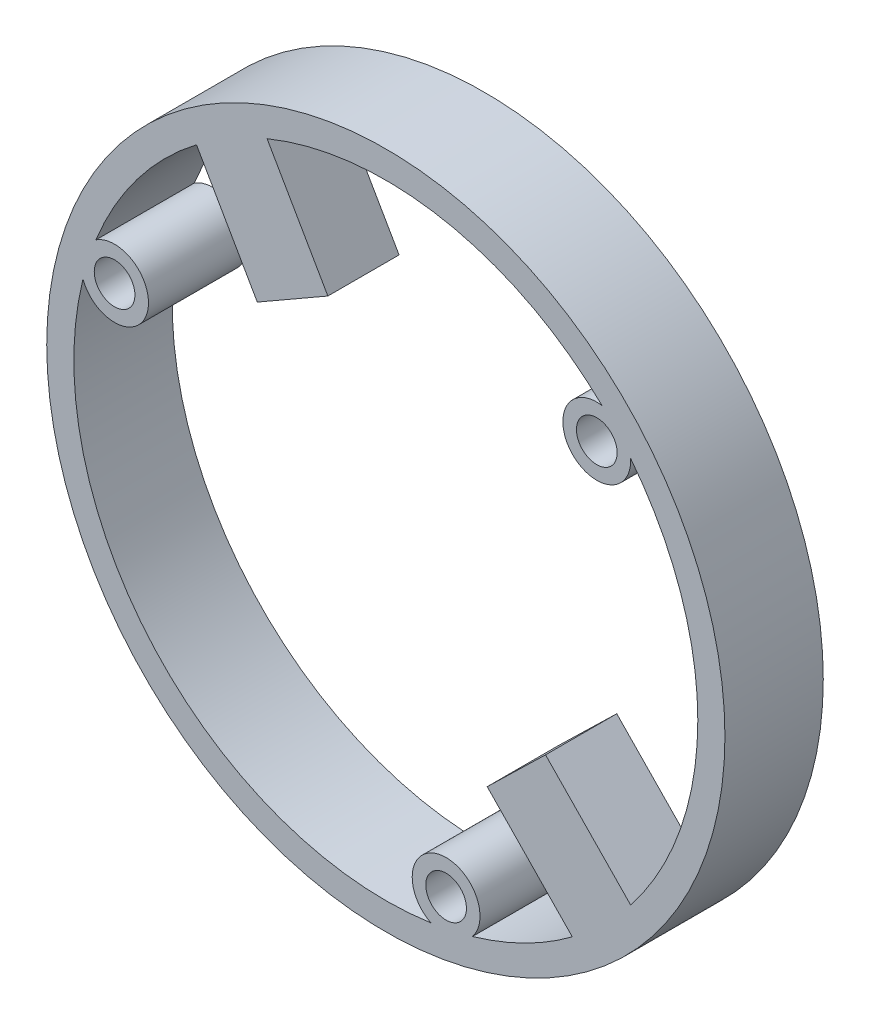
ISO-10303-21;
HEADER;
FILE_DESCRIPTION(('STEP AP214'),'2;1');
FILE_NAME('part.step','',(''),(''),'','','');
FILE_SCHEMA(('AUTOMOTIVE_DESIGN { 1 0 10303 214 1 1 1 1 }'));
ENDSEC;
DATA;
#1=APPLICATION_CONTEXT('core data for automotive mechanical design processes');
#2=APPLICATION_PROTOCOL_DEFINITION('international standard','automotive_design',2000,#1);
#3=PRODUCT_CONTEXT('',#1,'mechanical');
#4=PRODUCT('Part','Part','',(#3));
#5=PRODUCT_RELATED_PRODUCT_CATEGORY('part','',(#4));
#6=PRODUCT_DEFINITION_FORMATION('','',#4);
#7=PRODUCT_DEFINITION_CONTEXT('part definition',#1,'design');
#8=PRODUCT_DEFINITION('design','',#6,#7);
#9=PRODUCT_DEFINITION_SHAPE('','',#8);
#10=(LENGTH_UNIT() NAMED_UNIT(*) SI_UNIT(.MILLI.,.METRE.));
#11=(NAMED_UNIT(*) PLANE_ANGLE_UNIT() SI_UNIT($,.RADIAN.));
#12=(NAMED_UNIT(*) SI_UNIT($,.STERADIAN.) SOLID_ANGLE_UNIT());
#13=UNCERTAINTY_MEASURE_WITH_UNIT(LENGTH_MEASURE(1.E-05),#10,'distance_accuracy_value','');
#14=(GEOMETRIC_REPRESENTATION_CONTEXT(3) GLOBAL_UNCERTAINTY_ASSIGNED_CONTEXT((#13)) GLOBAL_UNIT_ASSIGNED_CONTEXT((#10,
#11,#12)) REPRESENTATION_CONTEXT('',''));
#15=CARTESIAN_POINT('',(0.,0.,0.));
#16=DIRECTION('',(0.,0.,1.));
#17=DIRECTION('',(1.,0.,0.));
#18=AXIS2_PLACEMENT_3D('',#15,#16,#17);
#19=CARTESIAN_POINT('',(-8.75506408313874,21.2684943731364,7.25));
#20=DIRECTION('',(-0.867166540666865,-0.498018263468181,0.));
#21=DIRECTION('',(0.498018263468181,-0.867166540666865,0.));
#22=AXIS2_PLACEMENT_3D('',#19,#20,#21);
#23=PLANE('',#22);
#24=DIRECTION('',(0.498018263468181,-0.867166540666865,0.));
#25=VECTOR('',#24,1.);
#26=CARTESIAN_POINT('',(-4.27289971192511,13.4639955071346,2.));
#27=LINE('',#26,#25);
#28=CARTESIAN_POINT('',(-8.75506408313874,21.2684943731364,2.));
#29=VERTEX_POINT('',#28);
#30=CARTESIAN_POINT('',(-4.27289971192511,13.4639955071346,2.));
#31=VERTEX_POINT('',#30);
#32=EDGE_CURVE('E286',#29,#31,#27,.T.);
#33=ORIENTED_EDGE('',*,*,#32,.F.);
#34=DIRECTION('',(0.,0.,-1.));
#35=VECTOR('',#34,1.);
#36=CARTESIAN_POINT('',(-8.75506408313874,21.2684943731364,7.25));
#37=LINE('',#36,#35);
#38=CARTESIAN_POINT('',(-8.75506408313874,21.2684943731364,7.25));
#39=VERTEX_POINT('',#38);
#40=EDGE_CURVE('E191',#39,#29,#37,.T.);
#41=ORIENTED_EDGE('',*,*,#40,.F.);
#42=DIRECTION('',(-0.498018263468181,0.867166540666865,0.));
#43=VECTOR('',#42,1.);
#44=CARTESIAN_POINT('',(-8.75506408313874,21.2684943731364,7.25));
#45=LINE('',#44,#43);
#46=CARTESIAN_POINT('',(-4.27289971192511,13.4639955071346,7.25));
#47=VERTEX_POINT('',#46);
#48=EDGE_CURVE('E307',#47,#39,#45,.T.);
#49=ORIENTED_EDGE('',*,*,#48,.F.);
#50=DIRECTION('',(0.,0.,-1.));
#51=VECTOR('',#50,1.);
#52=CARTESIAN_POINT('',(-4.27289971192511,13.4639955071346,7.25));
#53=LINE('',#52,#51);
#54=EDGE_CURVE('E194',#47,#31,#53,.T.);
#55=ORIENTED_EDGE('',*,*,#54,.T.);
#56=EDGE_LOOP('',(#33,#41,#49,#55));
#57=FACE_BOUND('',#56,.T.);
#58=ADVANCED_FACE('F45',(#57),#23,.F.);
#59=CARTESIAN_POINT('',(-4.27289971192511,13.4639955071346,7.25));
#60=DIRECTION('',(-0.49801826346818,0.867166540666865,0.));
#61=DIRECTION('',(-0.867166540666865,-0.498018263468181,0.));
#62=AXIS2_PLACEMENT_3D('',#59,#60,#61);
#63=PLANE('',#62);
#64=DIRECTION('',(-0.867166540666865,-0.49801826346818,0.));
#65=VECTOR('',#64,1.);
#66=CARTESIAN_POINT('',(-4.27289971192511,13.4639955071346,2.));
#67=LINE('',#66,#65);
#68=CARTESIAN_POINT('',(-9.4758989559263,10.4758859263255,2.));
#69=VERTEX_POINT('',#68);
#70=EDGE_CURVE('E280',#31,#69,#67,.T.);
#71=ORIENTED_EDGE('',*,*,#70,.F.);
#72=ORIENTED_EDGE('',*,*,#54,.F.);
#73=DIRECTION('',(0.867166540666865,0.49801826346818,0.));
#74=VECTOR('',#73,1.);
#75=CARTESIAN_POINT('',(-4.27289971192511,13.4639955071346,7.25));
#76=LINE('',#75,#74);
#77=CARTESIAN_POINT('',(-9.4758989559263,10.4758859263255,7.25));
#78=VERTEX_POINT('',#77);
#79=EDGE_CURVE('E304',#78,#47,#76,.T.);
#80=ORIENTED_EDGE('',*,*,#79,.F.);
#81=DIRECTION('',(0.,0.,-1.));
#82=VECTOR('',#81,1.);
#83=CARTESIAN_POINT('',(-9.4758989559263,10.4758859263255,7.25));
#84=LINE('',#83,#82);
#85=EDGE_CURVE('E197',#78,#69,#84,.T.);
#86=ORIENTED_EDGE('',*,*,#85,.T.);
#87=EDGE_LOOP('',(#71,#72,#80,#86));
#88=FACE_BOUND('',#87,.T.);
#89=ADVANCED_FACE('F373',(#88),#63,.F.);
#90=CARTESIAN_POINT('',(-13.9580633271399,18.2803847923273,7.25));
#91=DIRECTION('',(0.867166540666865,0.498018263468181,0.));
#92=DIRECTION('',(-0.498018263468181,0.867166540666865,0.));
#93=AXIS2_PLACEMENT_3D('',#90,#91,#92);
#94=PLANE('',#93);
#95=DIRECTION('',(-0.498018263468181,0.867166540666865,0.));
#96=VECTOR('',#95,1.);
#97=CARTESIAN_POINT('',(-9.4758989559263,10.4758859263255,2.));
#98=LINE('',#97,#96);
#99=CARTESIAN_POINT('',(-13.9580633271399,18.2803847923273,2.));
#100=VERTEX_POINT('',#99);
#101=EDGE_CURVE('E68',#69,#100,#98,.T.);
#102=ORIENTED_EDGE('',*,*,#101,.F.);
#103=ORIENTED_EDGE('',*,*,#85,.F.);
#104=DIRECTION('',(0.498018263468181,-0.867166540666865,0.));
#105=VECTOR('',#104,1.);
#106=CARTESIAN_POINT('',(-13.9580633271399,18.2803847923273,7.25));
#107=LINE('',#106,#105);
#108=CARTESIAN_POINT('',(-13.9580633271399,18.2803847923273,7.25));
#109=VERTEX_POINT('',#108);
#110=EDGE_CURVE('E301',#109,#78,#107,.T.);
#111=ORIENTED_EDGE('',*,*,#110,.F.);
#112=DIRECTION('',(0.,0.,-1.));
#113=VECTOR('',#112,1.);
#114=CARTESIAN_POINT('',(-13.9580633271399,18.2803847923273,7.25));
#115=LINE('',#114,#113);
#116=EDGE_CURVE('E200',#109,#100,#115,.T.);
#117=ORIENTED_EDGE('',*,*,#116,.T.);
#118=EDGE_LOOP('',(#102,#103,#111,#117));
#119=FACE_BOUND('',#118,.T.);
#120=ADVANCED_FACE('F370',(#119),#94,.F.);
#121=CARTESIAN_POINT('',(0.,0.,7.25));
#122=DIRECTION('',(0.,0.,1.));
#123=DIRECTION('',(1.,0.,0.));
#124=AXIS2_PLACEMENT_3D('',#121,#122,#123);
#125=PLANE('',#124);
#126=CARTESIAN_POINT('',(0.,0.,7.25));
#127=DIRECTION('',(0.,0.,1.));
#128=DIRECTION('',(1.,0.,0.));
#129=AXIS2_PLACEMENT_3D('',#126,#127,#128);
#130=CIRCLE('',#129,25.);
#131=CARTESIAN_POINT('',(25.,0.,7.25));
#132=VERTEX_POINT('',#131);
#133=EDGE_CURVE('E13',#132,#132,#130,.T.);
#134=ORIENTED_EDGE('',*,*,#133,.T.);
#135=EDGE_LOOP('',(#134));
#136=FACE_BOUND('',#135,.T.);
#137=CARTESIAN_POINT('',(15.5528440369997,14.1106003543706,7.25));
#138=DIRECTION('',(0.,0.,-1.));
#139=DIRECTION('',(-1.,0.,0.));
#140=AXIS2_PLACEMENT_3D('',#137,#138,#139);
#141=CIRCLE('',#140,1.5);
#142=CARTESIAN_POINT('',(14.0528440369997,14.1106003543706,7.25));
#143=VERTEX_POINT('',#142);
#144=EDGE_CURVE('E225',#143,#143,#141,.T.);
#145=ORIENTED_EDGE('',*,*,#144,.T.);
#146=EDGE_LOOP('',(#145));
#147=FACE_BOUND('',#146,.T.);
#148=CARTESIAN_POINT('',(-19.9965603880345,6.41385785995363,7.25));
#149=DIRECTION('',(0.,0.,-1.));
#150=DIRECTION('',(-1.,0.,0.));
#151=AXIS2_PLACEMENT_3D('',#148,#149,#150);
#152=CIRCLE('',#151,1.5);
#153=CARTESIAN_POINT('',(-21.4965603880345,6.41385785995363,7.25));
#154=VERTEX_POINT('',#153);
#155=EDGE_CURVE('E219',#154,#154,#152,.T.);
#156=ORIENTED_EDGE('',*,*,#155,.T.);
#157=EDGE_LOOP('',(#156));
#158=FACE_BOUND('',#157,.T.);
#159=CARTESIAN_POINT('',(4.44371635103502,-20.5244582143243,7.25));
#160=DIRECTION('',(0.,0.,-1.));
#161=DIRECTION('',(-1.,0.,0.));
#162=AXIS2_PLACEMENT_3D('',#159,#160,#161);
#163=CIRCLE('',#162,1.5);
#164=CARTESIAN_POINT('',(2.94371635103502,-20.5244582143243,7.25));
#165=VERTEX_POINT('',#164);
#166=EDGE_CURVE('E212',#165,#165,#163,.T.);
#167=ORIENTED_EDGE('',*,*,#166,.T.);
#168=EDGE_LOOP('',(#167));
#169=FACE_BOUND('',#168,.T.);
#170=CARTESIAN_POINT('',(0.,0.,7.25));
#171=DIRECTION('',(0.,0.,-1.));
#172=DIRECTION('',(-1.,0.,0.));
#173=AXIS2_PLACEMENT_3D('',#170,#171,#172);
#174=CIRCLE('',#173,23.);
#175=CARTESIAN_POINT('',(3.32222869980981,-22.7587960240905,7.25));
#176=VERTEX_POINT('',#175);
#177=CARTESIAN_POINT('',(-22.3291562878072,5.51441560590808,7.25));
#178=VERTEX_POINT('',#177);
#179=EDGE_CURVE('E252',#176,#178,#174,.T.);
#180=ORIENTED_EDGE('',*,*,#179,.T.);
#181=CARTESIAN_POINT('',(-19.9965603880345,6.41385785995373,7.25));
#182=DIRECTION('',(0.,0.,1.));
#183=DIRECTION('',(-1.,0.,0.));
#184=AXIS2_PLACEMENT_3D('',#181,#182,#183);
#185=CIRCLE('',#184,2.49999999999988);
#186=CARTESIAN_POINT('',(-21.3708098663157,8.50226356082779,7.25));
#187=VERTEX_POINT('',#186);
#188=EDGE_CURVE('E295',#178,#187,#185,.T.);
#189=ORIENTED_EDGE('',*,*,#188,.T.);
#190=CARTESIAN_POINT('',(0.,0.,7.25));
#191=DIRECTION('',(0.,0.,-1.));
#192=DIRECTION('',(-1.,0.,0.));
#193=AXIS2_PLACEMENT_3D('',#190,#191,#192);
#194=CIRCLE('',#193,23.);
#195=EDGE_CURVE('E298',#187,#109,#194,.T.);
#196=ORIENTED_EDGE('',*,*,#195,.T.);
#197=ORIENTED_EDGE('',*,*,#110,.T.);
#198=ORIENTED_EDGE('',*,*,#79,.T.);
#199=ORIENTED_EDGE('',*,*,#48,.T.);
#200=CARTESIAN_POINT('',(0.,0.,7.25));
#201=DIRECTION('',(0.,0.,-1.));
#202=DIRECTION('',(-1.,0.,0.));
#203=AXIS2_PLACEMENT_3D('',#200,#201,#202);
#204=CIRCLE('',#203,23.);
#205=CARTESIAN_POINT('',(15.940202145645,16.5804087873603,7.25));
#206=VERTEX_POINT('',#205);
#207=EDGE_CURVE('E310',#39,#206,#204,.T.);
#208=ORIENTED_EDGE('',*,*,#207,.T.);
#209=CARTESIAN_POINT('',(15.5528440369997,14.1106003543706,7.25));
#210=DIRECTION('',(0.,0.,1.));
#211=DIRECTION('',(-1.,0.,0.));
#212=AXIS2_PLACEMENT_3D('',#209,#210,#211);
#213=CIRCLE('',#212,2.50000000000001);
#214=CARTESIAN_POINT('',(18.0485811665056,14.2565324632626,7.25));
#215=VERTEX_POINT('',#214);
#216=EDGE_CURVE('E313',#206,#215,#213,.T.);
#217=ORIENTED_EDGE('',*,*,#216,.T.);
#218=CARTESIAN_POINT('',(0.,0.,7.25));
#219=DIRECTION('',(0.,0.,-1.));
#220=DIRECTION('',(-1.,0.,0.));
#221=AXIS2_PLACEMENT_3D('',#218,#219,#220);
#222=CIRCLE('',#221,23.);
#223=CARTESIAN_POINT('',(18.0485811665056,-14.2565324632626,7.25));
#224=VERTEX_POINT('',#223);
#225=EDGE_CURVE('E316',#215,#224,#222,.T.);
#226=ORIENTED_EDGE('',*,*,#225,.T.);
#227=DIRECTION('',(-0.697167063684968,0.716908700821018,0.));
#228=VECTOR('',#227,1.);
#229=CARTESIAN_POINT('',(18.0485811665056,-14.2565324632626,7.25));
#230=LINE('',#229,#228);
#231=CARTESIAN_POINT('',(11.7740775933409,-7.80435415587343,7.25));
#232=VERTEX_POINT('',#231);
#233=EDGE_CURVE('E319',#224,#232,#230,.T.);
#234=ORIENTED_EDGE('',*,*,#233,.T.);
#235=DIRECTION('',(-0.716908700821018,-0.697167063684968,0.));
#236=VECTOR('',#235,1.);
#237=CARTESIAN_POINT('',(11.7740775933409,-7.80435415587343,7.25));
#238=LINE('',#237,#236);
#239=CARTESIAN_POINT('',(7.47262538841476,-11.9873565379832,7.25));
#240=VERTEX_POINT('',#239);
#241=EDGE_CURVE('E178',#232,#240,#238,.T.);
#242=ORIENTED_EDGE('',*,*,#241,.T.);
#243=DIRECTION('',(0.697167063684968,-0.716908700821018,0.));
#244=VECTOR('',#243,1.);
#245=CARTESIAN_POINT('',(13.7471289615795,-18.4395348453724,7.25));
#246=LINE('',#245,#244);
#247=CARTESIAN_POINT('',(13.7471289615795,-18.4395348453724,7.25));
#248=VERTEX_POINT('',#247);
#249=EDGE_CURVE('E270',#240,#248,#246,.T.);
#250=ORIENTED_EDGE('',*,*,#249,.T.);
#251=CARTESIAN_POINT('',(0.,0.,7.25));
#252=DIRECTION('',(0.,0.,-1.));
#253=DIRECTION('',(-1.,0.,0.));
#254=AXIS2_PLACEMENT_3D('',#251,#252,#253);
#255=CIRCLE('',#254,23.);
#256=CARTESIAN_POINT('',(6.38895414216217,-22.094824393268,7.25));
#257=VERTEX_POINT('',#256);
#258=EDGE_CURVE('E265',#248,#257,#255,.T.);
#259=ORIENTED_EDGE('',*,*,#258,.T.);
#260=CARTESIAN_POINT('',(4.44371635103482,-20.5244582143243,7.25));
#261=DIRECTION('',(0.,0.,1.));
#262=DIRECTION('',(-1.,0.,0.));
#263=AXIS2_PLACEMENT_3D('',#260,#261,#262);
#264=CIRCLE('',#263,2.50000000000012);
#265=EDGE_CURVE('E208',#257,#176,#264,.T.);
#266=ORIENTED_EDGE('',*,*,#265,.T.);
#267=EDGE_LOOP('',(#180,#189,#196,#197,#198,#199,#208,#217,#226,#234,#242,#250,#259,#266));
#268=FACE_BOUND('',#267,.T.);
#269=ADVANCED_FACE('F236',(#136,#147,#158,#169,#268),#125,.T.);
#270=CARTESIAN_POINT('',(0.,0.,0.));
#271=DIRECTION('',(0.,0.,1.));
#272=DIRECTION('',(1.,0.,0.));
#273=AXIS2_PLACEMENT_3D('',#270,#271,#272);
#274=PLANE('',#273);
#275=CARTESIAN_POINT('',(4.44371635103502,-20.5244582143243,0.));
#276=DIRECTION('',(0.,0.,-1.));
#277=DIRECTION('',(-1.,0.,0.));
#278=AXIS2_PLACEMENT_3D('',#275,#276,#277);
#279=CIRCLE('',#278,1.5);
#280=CARTESIAN_POINT('',(2.94371635103502,-20.5244582143243,0.));
#281=VERTEX_POINT('',#280);
#282=EDGE_CURVE('E209',#281,#281,#279,.T.);
#283=ORIENTED_EDGE('',*,*,#282,.F.);
#284=EDGE_LOOP('',(#283));
#285=FACE_BOUND('',#284,.T.);
#286=CARTESIAN_POINT('',(-19.9965603880345,6.41385785995363,0.));
#287=DIRECTION('',(0.,0.,-1.));
#288=DIRECTION('',(-1.,0.,0.));
#289=AXIS2_PLACEMENT_3D('',#286,#287,#288);
#290=CIRCLE('',#289,1.5);
#291=CARTESIAN_POINT('',(-21.4965603880345,6.41385785995363,0.));
#292=VERTEX_POINT('',#291);
#293=EDGE_CURVE('E216',#292,#292,#290,.T.);
#294=ORIENTED_EDGE('',*,*,#293,.F.);
#295=EDGE_LOOP('',(#294));
#296=FACE_BOUND('',#295,.T.);
#297=CARTESIAN_POINT('',(15.5528440369997,14.1106003543706,0.));
#298=DIRECTION('',(0.,0.,-1.));
#299=DIRECTION('',(-1.,0.,0.));
#300=AXIS2_PLACEMENT_3D('',#297,#298,#299);
#301=CIRCLE('',#300,1.5);
#302=CARTESIAN_POINT('',(14.0528440369997,14.1106003543706,0.));
#303=VERTEX_POINT('',#302);
#304=EDGE_CURVE('E222',#303,#303,#301,.T.);
#305=ORIENTED_EDGE('',*,*,#304,.F.);
#306=EDGE_LOOP('',(#305));
#307=FACE_BOUND('',#306,.T.);
#308=CARTESIAN_POINT('',(0.,0.,0.));
#309=DIRECTION('',(0.,0.,1.));
#310=DIRECTION('',(1.,0.,0.));
#311=AXIS2_PLACEMENT_3D('',#308,#309,#310);
#312=CIRCLE('',#311,25.);
#313=CARTESIAN_POINT('',(25.,0.,0.));
#314=VERTEX_POINT('',#313);
#315=EDGE_CURVE('E49',#314,#314,#312,.T.);
#316=ORIENTED_EDGE('',*,*,#315,.F.);
#317=EDGE_LOOP('',(#316));
#318=FACE_BOUND('',#317,.T.);
#319=CARTESIAN_POINT('',(0.,0.,0.));
#320=DIRECTION('',(0.,0.,-1.));
#321=DIRECTION('',(-1.,0.,0.));
#322=AXIS2_PLACEMENT_3D('',#319,#320,#321);
#323=CIRCLE('',#322,23.);
#324=CARTESIAN_POINT('',(13.7471289615795,-18.4395348453724,0.));
#325=VERTEX_POINT('',#324);
#326=CARTESIAN_POINT('',(6.38895414216217,-22.094824393268,0.));
#327=VERTEX_POINT('',#326);
#328=EDGE_CURVE('E242',#325,#327,#323,.T.);
#329=ORIENTED_EDGE('',*,*,#328,.F.);
#330=DIRECTION('',(-0.716908700821018,-0.697167063684968,0.));
#331=VECTOR('',#330,1.);
#332=CARTESIAN_POINT('',(18.0485811665056,-14.2565324632626,0.));
#333=LINE('',#332,#331);
#334=CARTESIAN_POINT('',(18.0485811665056,-14.2565324632626,0.));
#335=VERTEX_POINT('',#334);
#336=EDGE_CURVE('E165',#335,#325,#333,.T.);
#337=ORIENTED_EDGE('',*,*,#336,.F.);
#338=CARTESIAN_POINT('',(0.,0.,0.));
#339=DIRECTION('',(0.,0.,-1.));
#340=DIRECTION('',(-1.,0.,0.));
#341=AXIS2_PLACEMENT_3D('',#338,#339,#340);
#342=CIRCLE('',#341,23.);
#343=CARTESIAN_POINT('',(18.0485811665056,14.2565324632626,0.));
#344=VERTEX_POINT('',#343);
#345=EDGE_CURVE('E250',#344,#335,#342,.T.);
#346=ORIENTED_EDGE('',*,*,#345,.F.);
#347=CARTESIAN_POINT('',(15.5528440369997,14.1106003543706,0.));
#348=DIRECTION('',(0.,0.,1.));
#349=DIRECTION('',(-1.,0.,0.));
#350=AXIS2_PLACEMENT_3D('',#347,#348,#349);
#351=CIRCLE('',#350,2.50000000000001);
#352=CARTESIAN_POINT('',(15.940202145645,16.5804087873603,0.));
#353=VERTEX_POINT('',#352);
#354=EDGE_CURVE('E254',#353,#344,#351,.T.);
#355=ORIENTED_EDGE('',*,*,#354,.F.);
#356=CARTESIAN_POINT('',(0.,0.,0.));
#357=DIRECTION('',(0.,0.,-1.));
#358=DIRECTION('',(-1.,0.,0.));
#359=AXIS2_PLACEMENT_3D('',#356,#357,#358);
#360=CIRCLE('',#359,23.);
#361=CARTESIAN_POINT('',(-8.75506408313874,21.2684943731364,0.));
#362=VERTEX_POINT('',#361);
#363=EDGE_CURVE('E333',#362,#353,#360,.T.);
#364=ORIENTED_EDGE('',*,*,#363,.F.);
#365=DIRECTION('',(0.867166540666865,0.498018263468181,0.));
#366=VECTOR('',#365,1.);
#367=CARTESIAN_POINT('',(-8.75506408313874,21.2684943731364,0.));
#368=LINE('',#367,#366);
#369=CARTESIAN_POINT('',(-13.9580633271399,18.2803847923273,0.));
#370=VERTEX_POINT('',#369);
#371=EDGE_CURVE('E282',#370,#362,#368,.T.);
#372=ORIENTED_EDGE('',*,*,#371,.F.);
#373=CARTESIAN_POINT('',(0.,0.,0.));
#374=DIRECTION('',(0.,0.,-1.));
#375=DIRECTION('',(-1.,0.,0.));
#376=AXIS2_PLACEMENT_3D('',#373,#374,#375);
#377=CIRCLE('',#376,23.);
#378=CARTESIAN_POINT('',(-21.3708098663157,8.50226356082779,0.));
#379=VERTEX_POINT('',#378);
#380=EDGE_CURVE('E330',#379,#370,#377,.T.);
#381=ORIENTED_EDGE('',*,*,#380,.F.);
#382=CARTESIAN_POINT('',(-19.9965603880345,6.41385785995373,0.));
#383=DIRECTION('',(0.,0.,1.));
#384=DIRECTION('',(-1.,0.,0.));
#385=AXIS2_PLACEMENT_3D('',#382,#383,#384);
#386=CIRCLE('',#385,2.49999999999988);
#387=CARTESIAN_POINT('',(-22.3291562878072,5.51441560590808,0.));
#388=VERTEX_POINT('',#387);
#389=EDGE_CURVE('E327',#388,#379,#386,.T.);
#390=ORIENTED_EDGE('',*,*,#389,.F.);
#391=CARTESIAN_POINT('',(0.,0.,0.));
#392=DIRECTION('',(0.,0.,-1.));
#393=DIRECTION('',(-1.,0.,0.));
#394=AXIS2_PLACEMENT_3D('',#391,#392,#393);
#395=CIRCLE('',#394,23.);
#396=CARTESIAN_POINT('',(3.32222869980981,-22.7587960240905,0.));
#397=VERTEX_POINT('',#396);
#398=EDGE_CURVE('E278',#397,#388,#395,.T.);
#399=ORIENTED_EDGE('',*,*,#398,.F.);
#400=CARTESIAN_POINT('',(4.44371635103482,-20.5244582143243,0.));
#401=DIRECTION('',(0.,0.,1.));
#402=DIRECTION('',(-1.,0.,0.));
#403=AXIS2_PLACEMENT_3D('',#400,#401,#402);
#404=CIRCLE('',#403,2.50000000000012);
#405=EDGE_CURVE('E247',#327,#397,#404,.T.);
#406=ORIENTED_EDGE('',*,*,#405,.F.);
#407=EDGE_LOOP('',(#329,#337,#346,#355,#364,#372,#381,#390,#399,#406));
#408=FACE_BOUND('',#407,.T.);
#409=ADVANCED_FACE('F233',(#285,#296,#307,#318,#408),#274,.F.);
#410=CARTESIAN_POINT('',(0.,0.,7.25));
#411=DIRECTION('',(0.,0.,-1.));
#412=DIRECTION('',(-1.,0.,0.));
#413=AXIS2_PLACEMENT_3D('',#410,#411,#412);
#414=CYLINDRICAL_SURFACE('',#413,25.);
#415=ORIENTED_EDGE('',*,*,#133,.F.);
#416=EDGE_LOOP('',(#415));
#417=FACE_BOUND('',#416,.T.);
#418=ORIENTED_EDGE('',*,*,#315,.T.);
#419=EDGE_LOOP('',(#418));
#420=FACE_BOUND('',#419,.T.);
#421=ADVANCED_FACE('F47',(#417,#420),#414,.T.);
#422=CARTESIAN_POINT('',(15.5528440369997,14.1106003543706,0.));
#423=DIRECTION('',(0.,0.,-1.));
#424=DIRECTION('',(-1.,0.,0.));
#425=AXIS2_PLACEMENT_3D('',#422,#423,#424);
#426=CYLINDRICAL_SURFACE('',#425,1.5);
#427=ORIENTED_EDGE('',*,*,#144,.F.);
#428=EDGE_LOOP('',(#427));
#429=FACE_BOUND('',#428,.T.);
#430=ORIENTED_EDGE('',*,*,#304,.T.);
#431=EDGE_LOOP('',(#430));
#432=FACE_BOUND('',#431,.T.);
#433=ADVANCED_FACE('F410',(#429,#432),#426,.F.);
#434=CARTESIAN_POINT('',(-19.9965603880345,6.41385785995363,0.));
#435=DIRECTION('',(0.,0.,-1.));
#436=DIRECTION('',(-1.,0.,0.));
#437=AXIS2_PLACEMENT_3D('',#434,#435,#436);
#438=CYLINDRICAL_SURFACE('',#437,1.5);
#439=ORIENTED_EDGE('',*,*,#155,.F.);
#440=EDGE_LOOP('',(#439));
#441=FACE_BOUND('',#440,.T.);
#442=ORIENTED_EDGE('',*,*,#293,.T.);
#443=EDGE_LOOP('',(#442));
#444=FACE_BOUND('',#443,.T.);
#445=ADVANCED_FACE('F406',(#441,#444),#438,.F.);
#446=CARTESIAN_POINT('',(4.44371635103502,-20.5244582143243,0.));
#447=DIRECTION('',(0.,0.,-1.));
#448=DIRECTION('',(-1.,0.,0.));
#449=AXIS2_PLACEMENT_3D('',#446,#447,#448);
#450=CYLINDRICAL_SURFACE('',#449,1.5);
#451=ORIENTED_EDGE('',*,*,#166,.F.);
#452=EDGE_LOOP('',(#451));
#453=FACE_BOUND('',#452,.T.);
#454=ORIENTED_EDGE('',*,*,#282,.T.);
#455=EDGE_LOOP('',(#454));
#456=FACE_BOUND('',#455,.T.);
#457=ADVANCED_FACE('F403',(#453,#456),#450,.F.);
#458=CARTESIAN_POINT('',(0.,0.,7.25));
#459=DIRECTION('',(0.,0.,-1.));
#460=DIRECTION('',(-1.,0.,0.));
#461=AXIS2_PLACEMENT_3D('',#458,#459,#460);
#462=CYLINDRICAL_SURFACE('',#461,23.);
#463=ORIENTED_EDGE('',*,*,#398,.T.);
#464=DIRECTION('',(0.,0.,-1.));
#465=VECTOR('',#464,1.);
#466=CARTESIAN_POINT('',(-22.3291562878072,5.51441560590808,7.25));
#467=LINE('',#466,#465);
#468=EDGE_CURVE('E205',#178,#388,#467,.T.);
#469=ORIENTED_EDGE('',*,*,#468,.F.);
#470=ORIENTED_EDGE('',*,*,#179,.F.);
#471=DIRECTION('',(0.,0.,-1.));
#472=VECTOR('',#471,1.);
#473=CARTESIAN_POINT('',(3.32222869980981,-22.7587960240905,7.25));
#474=LINE('',#473,#472);
#475=EDGE_CURVE('E213',#176,#397,#474,.T.);
#476=ORIENTED_EDGE('',*,*,#475,.T.);
#477=EDGE_LOOP('',(#463,#469,#470,#476));
#478=FACE_BOUND('',#477,.T.);
#479=ADVANCED_FACE('F362',(#478),#462,.F.);
#480=CARTESIAN_POINT('',(4.44371635103482,-20.5244582143243,7.25));
#481=DIRECTION('',(0.,0.,-1.));
#482=DIRECTION('',(-1.,0.,0.));
#483=AXIS2_PLACEMENT_3D('',#480,#481,#482);
#484=CYLINDRICAL_SURFACE('',#483,2.50000000000012);
#485=ORIENTED_EDGE('',*,*,#405,.T.);
#486=ORIENTED_EDGE('',*,*,#475,.F.);
#487=ORIENTED_EDGE('',*,*,#265,.F.);
#488=DIRECTION('',(0.,0.,-1.));
#489=VECTOR('',#488,1.);
#490=CARTESIAN_POINT('',(6.38895414216217,-22.094824393268,7.25));
#491=LINE('',#490,#489);
#492=EDGE_CURVE('E259',#257,#327,#491,.T.);
#493=ORIENTED_EDGE('',*,*,#492,.T.);
#494=EDGE_LOOP('',(#485,#486,#487,#493));
#495=FACE_BOUND('',#494,.T.);
#496=ADVANCED_FACE('F366',(#495),#484,.T.);
#497=CARTESIAN_POINT('',(0.,0.,7.25));
#498=DIRECTION('',(0.,0.,-1.));
#499=DIRECTION('',(-1.,0.,0.));
#500=AXIS2_PLACEMENT_3D('',#497,#498,#499);
#501=CYLINDRICAL_SURFACE('',#500,23.);
#502=ORIENTED_EDGE('',*,*,#328,.T.);
#503=ORIENTED_EDGE('',*,*,#492,.F.);
#504=ORIENTED_EDGE('',*,*,#258,.F.);
#505=DIRECTION('',(0.,0.,-1.));
#506=VECTOR('',#505,1.);
#507=CARTESIAN_POINT('',(13.7471289615795,-18.4395348453724,7.25));
#508=LINE('',#507,#506);
#509=CARTESIAN_POINT('',(13.7471289615795,-18.4395348453724,2.));
#510=VERTEX_POINT('',#509);
#511=EDGE_CURVE('E182',#248,#510,#508,.T.);
#512=ORIENTED_EDGE('',*,*,#511,.T.);
#513=DIRECTION('',(0.,0.,-1.));
#514=VECTOR('',#513,1.);
#515=CARTESIAN_POINT('',(13.7471289615795,-18.4395348453724,2.));
#516=LINE('',#515,#514);
#517=EDGE_CURVE('E263',#510,#325,#516,.T.);
#518=ORIENTED_EDGE('',*,*,#517,.T.);
#519=EDGE_LOOP('',(#502,#503,#504,#512,#518));
#520=FACE_BOUND('',#519,.T.);
#521=ADVANCED_FACE('F262',(#520),#501,.F.);
#522=CARTESIAN_POINT('',(13.7471289615795,-18.4395348453724,7.25));
#523=DIRECTION('',(0.716908700821018,0.697167063684968,0.));
#524=DIRECTION('',(-0.697167063684968,0.716908700821018,0.));
#525=AXIS2_PLACEMENT_3D('',#522,#523,#524);
#526=PLANE('',#525);
#527=DIRECTION('',(0.,0.,-1.));
#528=VECTOR('',#527,1.);
#529=CARTESIAN_POINT('',(7.47262538841476,-11.9873565379832,7.25));
#530=LINE('',#529,#528);
#531=CARTESIAN_POINT('',(7.47262538841476,-11.9873565379832,2.));
#532=VERTEX_POINT('',#531);
#533=EDGE_CURVE('E180',#240,#532,#530,.T.);
#534=ORIENTED_EDGE('',*,*,#533,.T.);
#535=DIRECTION('',(-0.697167063684968,0.716908700821018,0.));
#536=VECTOR('',#535,1.);
#537=CARTESIAN_POINT('',(7.47262538841476,-11.9873565379832,2.));
#538=LINE('',#537,#536);
#539=EDGE_CURVE('E161',#510,#532,#538,.T.);
#540=ORIENTED_EDGE('',*,*,#539,.F.);
#541=ORIENTED_EDGE('',*,*,#511,.F.);
#542=ORIENTED_EDGE('',*,*,#249,.F.);
#543=EDGE_LOOP('',(#534,#540,#541,#542));
#544=FACE_BOUND('',#543,.T.);
#545=ADVANCED_FACE('F269',(#544),#526,.F.);
#546=CARTESIAN_POINT('',(11.7740775933409,-7.80435415587343,7.25));
#547=DIRECTION('',(0.697167063684968,-0.716908700821018,0.));
#548=DIRECTION('',(0.716908700821018,0.697167063684968,0.));
#549=AXIS2_PLACEMENT_3D('',#546,#547,#548);
#550=PLANE('',#549);
#551=DIRECTION('',(0.,0.,-1.));
#552=VECTOR('',#551,1.);
#553=CARTESIAN_POINT('',(11.7740775933409,-7.80435415587343,7.25));
#554=LINE('',#553,#552);
#555=CARTESIAN_POINT('',(11.7740775933409,-7.80435415587343,2.));
#556=VERTEX_POINT('',#555);
#557=EDGE_CURVE('E171',#232,#556,#554,.T.);
#558=ORIENTED_EDGE('',*,*,#557,.T.);
#559=DIRECTION('',(0.716908700821018,0.697167063684968,0.));
#560=VECTOR('',#559,1.);
#561=CARTESIAN_POINT('',(11.7740775933409,-7.80435415587343,2.));
#562=LINE('',#561,#560);
#563=EDGE_CURVE('E158',#532,#556,#562,.T.);
#564=ORIENTED_EDGE('',*,*,#563,.F.);
#565=ORIENTED_EDGE('',*,*,#533,.F.);
#566=ORIENTED_EDGE('',*,*,#241,.F.);
#567=EDGE_LOOP('',(#558,#564,#565,#566));
#568=FACE_BOUND('',#567,.T.);
#569=ADVANCED_FACE('F176',(#568),#550,.F.);
#570=CARTESIAN_POINT('',(18.0485811665056,-14.2565324632626,7.25));
#571=DIRECTION('',(-0.716908700821018,-0.697167063684968,0.));
#572=DIRECTION('',(0.697167063684968,-0.716908700821018,0.));
#573=AXIS2_PLACEMENT_3D('',#570,#571,#572);
#574=PLANE('',#573);
#575=DIRECTION('',(0.,0.,-1.));
#576=VECTOR('',#575,1.);
#577=CARTESIAN_POINT('',(18.0485811665056,-14.2565324632626,7.25));
#578=LINE('',#577,#576);
#579=CARTESIAN_POINT('',(18.0485811665056,-14.2565324632626,2.));
#580=VERTEX_POINT('',#579);
#581=EDGE_CURVE('E173',#224,#580,#578,.T.);
#582=ORIENTED_EDGE('',*,*,#581,.T.);
#583=DIRECTION('',(0.697167063684968,-0.716908700821018,0.));
#584=VECTOR('',#583,1.);
#585=CARTESIAN_POINT('',(11.7740775933409,-7.80435415587343,2.));
#586=LINE('',#585,#584);
#587=EDGE_CURVE('E60',#556,#580,#586,.T.);
#588=ORIENTED_EDGE('',*,*,#587,.F.);
#589=ORIENTED_EDGE('',*,*,#557,.F.);
#590=ORIENTED_EDGE('',*,*,#233,.F.);
#591=EDGE_LOOP('',(#582,#588,#589,#590));
#592=FACE_BOUND('',#591,.T.);
#593=ADVANCED_FACE('F169',(#592),#574,.F.);
#594=CARTESIAN_POINT('',(0.,0.,7.25));
#595=DIRECTION('',(0.,0.,-1.));
#596=DIRECTION('',(-1.,0.,0.));
#597=AXIS2_PLACEMENT_3D('',#594,#595,#596);
#598=CYLINDRICAL_SURFACE('',#597,23.);
#599=ORIENTED_EDGE('',*,*,#345,.T.);
#600=DIRECTION('',(0.,0.,-1.));
#601=VECTOR('',#600,1.);
#602=CARTESIAN_POINT('',(18.0485811665056,-14.2565324632626,2.));
#603=LINE('',#602,#601);
#604=EDGE_CURVE('E271',#580,#335,#603,.T.);
#605=ORIENTED_EDGE('',*,*,#604,.F.);
#606=ORIENTED_EDGE('',*,*,#581,.F.);
#607=ORIENTED_EDGE('',*,*,#225,.F.);
#608=DIRECTION('',(0.,0.,-1.));
#609=VECTOR('',#608,1.);
#610=CARTESIAN_POINT('',(18.0485811665056,14.2565324632626,7.25));
#611=LINE('',#610,#609);
#612=EDGE_CURVE('E184',#215,#344,#611,.T.);
#613=ORIENTED_EDGE('',*,*,#612,.T.);
#614=EDGE_LOOP('',(#599,#605,#606,#607,#613));
#615=FACE_BOUND('',#614,.T.);
#616=ADVANCED_FACE('F344',(#615),#598,.F.);
#617=CARTESIAN_POINT('',(15.5528440369997,14.1106003543706,7.25));
#618=DIRECTION('',(0.,0.,-1.));
#619=DIRECTION('',(-1.,0.,0.));
#620=AXIS2_PLACEMENT_3D('',#617,#618,#619);
#621=CYLINDRICAL_SURFACE('',#620,2.50000000000001);
#622=ORIENTED_EDGE('',*,*,#354,.T.);
#623=ORIENTED_EDGE('',*,*,#612,.F.);
#624=ORIENTED_EDGE('',*,*,#216,.F.);
#625=DIRECTION('',(0.,0.,-1.));
#626=VECTOR('',#625,1.);
#627=CARTESIAN_POINT('',(15.940202145645,16.5804087873603,7.25));
#628=LINE('',#627,#626);
#629=EDGE_CURVE('E189',#206,#353,#628,.T.);
#630=ORIENTED_EDGE('',*,*,#629,.T.);
#631=EDGE_LOOP('',(#622,#623,#624,#630));
#632=FACE_BOUND('',#631,.T.);
#633=ADVANCED_FACE('F338',(#632),#621,.T.);
#634=CARTESIAN_POINT('',(0.,0.,7.25));
#635=DIRECTION('',(0.,0.,-1.));
#636=DIRECTION('',(-1.,0.,0.));
#637=AXIS2_PLACEMENT_3D('',#634,#635,#636);
#638=CYLINDRICAL_SURFACE('',#637,23.);
#639=ORIENTED_EDGE('',*,*,#363,.T.);
#640=ORIENTED_EDGE('',*,*,#629,.F.);
#641=ORIENTED_EDGE('',*,*,#207,.F.);
#642=ORIENTED_EDGE('',*,*,#40,.T.);
#643=DIRECTION('',(0.,0.,-1.));
#644=VECTOR('',#643,1.);
#645=CARTESIAN_POINT('',(-8.75506408313874,21.2684943731364,2.));
#646=LINE('',#645,#644);
#647=EDGE_CURVE('E277',#29,#362,#646,.T.);
#648=ORIENTED_EDGE('',*,*,#647,.T.);
#649=EDGE_LOOP('',(#639,#640,#641,#642,#648));
#650=FACE_BOUND('',#649,.T.);
#651=ADVANCED_FACE('F349',(#650),#638,.F.);
#652=CARTESIAN_POINT('',(0.,0.,7.25));
#653=DIRECTION('',(0.,0.,-1.));
#654=DIRECTION('',(-1.,0.,0.));
#655=AXIS2_PLACEMENT_3D('',#652,#653,#654);
#656=CYLINDRICAL_SURFACE('',#655,23.);
#657=ORIENTED_EDGE('',*,*,#380,.T.);
#658=DIRECTION('',(0.,0.,-1.));
#659=VECTOR('',#658,1.);
#660=CARTESIAN_POINT('',(-13.9580633271399,18.2803847923273,2.));
#661=LINE('',#660,#659);
#662=EDGE_CURVE('E288',#100,#370,#661,.T.);
#663=ORIENTED_EDGE('',*,*,#662,.F.);
#664=ORIENTED_EDGE('',*,*,#116,.F.);
#665=ORIENTED_EDGE('',*,*,#195,.F.);
#666=DIRECTION('',(0.,0.,-1.));
#667=VECTOR('',#666,1.);
#668=CARTESIAN_POINT('',(-21.3708098663157,8.50226356082779,7.25));
#669=LINE('',#668,#667);
#670=EDGE_CURVE('E203',#187,#379,#669,.T.);
#671=ORIENTED_EDGE('',*,*,#670,.T.);
#672=EDGE_LOOP('',(#657,#663,#664,#665,#671));
#673=FACE_BOUND('',#672,.T.);
#674=ADVANCED_FACE('F356',(#673),#656,.F.);
#675=CARTESIAN_POINT('',(-19.9965603880345,6.41385785995373,7.25));
#676=DIRECTION('',(0.,0.,-1.));
#677=DIRECTION('',(-1.,0.,0.));
#678=AXIS2_PLACEMENT_3D('',#675,#676,#677);
#679=CYLINDRICAL_SURFACE('',#678,2.49999999999988);
#680=ORIENTED_EDGE('',*,*,#389,.T.);
#681=ORIENTED_EDGE('',*,*,#670,.F.);
#682=ORIENTED_EDGE('',*,*,#188,.F.);
#683=ORIENTED_EDGE('',*,*,#468,.T.);
#684=EDGE_LOOP('',(#680,#681,#682,#683));
#685=FACE_BOUND('',#684,.T.);
#686=ADVANCED_FACE('F360',(#685),#679,.T.);
#687=CARTESIAN_POINT('',(-8.75506408313874,21.2684943731364,2.));
#688=DIRECTION('',(-0.498018263468181,0.867166540666865,0.));
#689=DIRECTION('',(-0.867166540666865,-0.498018263468181,0.));
#690=AXIS2_PLACEMENT_3D('',#687,#688,#689);
#691=PLANE('',#690);
#692=ORIENTED_EDGE('',*,*,#371,.T.);
#693=ORIENTED_EDGE('',*,*,#647,.F.);
#694=DIRECTION('',(0.867166540666865,0.498018263468181,0.));
#695=VECTOR('',#694,1.);
#696=CARTESIAN_POINT('',(-8.75506408313874,21.2684943731364,2.));
#697=LINE('',#696,#695);
#698=EDGE_CURVE('E284',#100,#29,#697,.T.);
#699=ORIENTED_EDGE('',*,*,#698,.F.);
#700=ORIENTED_EDGE('',*,*,#662,.T.);
#701=EDGE_LOOP('',(#692,#693,#699,#700));
#702=FACE_BOUND('',#701,.T.);
#703=ADVANCED_FACE('F377',(#702),#691,.F.);
#704=CARTESIAN_POINT('',(0.,0.,2.));
#705=DIRECTION('',(0.,0.,-1.));
#706=DIRECTION('',(-1.,0.,0.));
#707=AXIS2_PLACEMENT_3D('',#704,#705,#706);
#708=PLANE('',#707);
#709=ORIENTED_EDGE('',*,*,#70,.T.);
#710=ORIENTED_EDGE('',*,*,#101,.T.);
#711=ORIENTED_EDGE('',*,*,#698,.T.);
#712=ORIENTED_EDGE('',*,*,#32,.T.);
#713=EDGE_LOOP('',(#709,#710,#711,#712));
#714=FACE_BOUND('',#713,.T.);
#715=ADVANCED_FACE('F376',(#714),#708,.T.);
#716=CARTESIAN_POINT('',(18.0485811665056,-14.2565324632626,2.));
#717=DIRECTION('',(0.697167063684968,-0.716908700821018,0.));
#718=DIRECTION('',(0.716908700821018,0.697167063684968,0.));
#719=AXIS2_PLACEMENT_3D('',#716,#717,#718);
#720=PLANE('',#719);
#721=ORIENTED_EDGE('',*,*,#336,.T.);
#722=ORIENTED_EDGE('',*,*,#517,.F.);
#723=DIRECTION('',(-0.716908700821018,-0.697167063684968,0.));
#724=VECTOR('',#723,1.);
#725=CARTESIAN_POINT('',(18.0485811665056,-14.2565324632626,2.));
#726=LINE('',#725,#724);
#727=EDGE_CURVE('E174',#580,#510,#726,.T.);
#728=ORIENTED_EDGE('',*,*,#727,.F.);
#729=ORIENTED_EDGE('',*,*,#604,.T.);
#730=EDGE_LOOP('',(#721,#722,#728,#729));
#731=FACE_BOUND('',#730,.T.);
#732=ADVANCED_FACE('F384',(#731),#720,.F.);
#733=CARTESIAN_POINT('',(0.,0.,2.));
#734=DIRECTION('',(0.,0.,1.));
#735=DIRECTION('',(1.,0.,0.));
#736=AXIS2_PLACEMENT_3D('',#733,#734,#735);
#737=PLANE('',#736);
#738=ORIENTED_EDGE('',*,*,#563,.T.);
#739=ORIENTED_EDGE('',*,*,#587,.T.);
#740=ORIENTED_EDGE('',*,*,#727,.T.);
#741=ORIENTED_EDGE('',*,*,#539,.T.);
#742=EDGE_LOOP('',(#738,#739,#740,#741));
#743=FACE_BOUND('',#742,.T.);
#744=ADVANCED_FACE('F159',(#743),#737,.F.);
#745=CLOSED_SHELL('',(#58,#89,#120,#269,#409,#421,#433,#445,#457,#479,#496,#521,#545,#569,#593,
#616,#633,#651,#674,#686,#703,#715,#732,#744));
#746=MANIFOLD_SOLID_BREP('B2',#745);
#747=ADVANCED_BREP_SHAPE_REPRESENTATION('',(#18,#746),#14);
#748=SHAPE_DEFINITION_REPRESENTATION(#9,#747);
ENDSEC;
END-ISO-10303-21;
